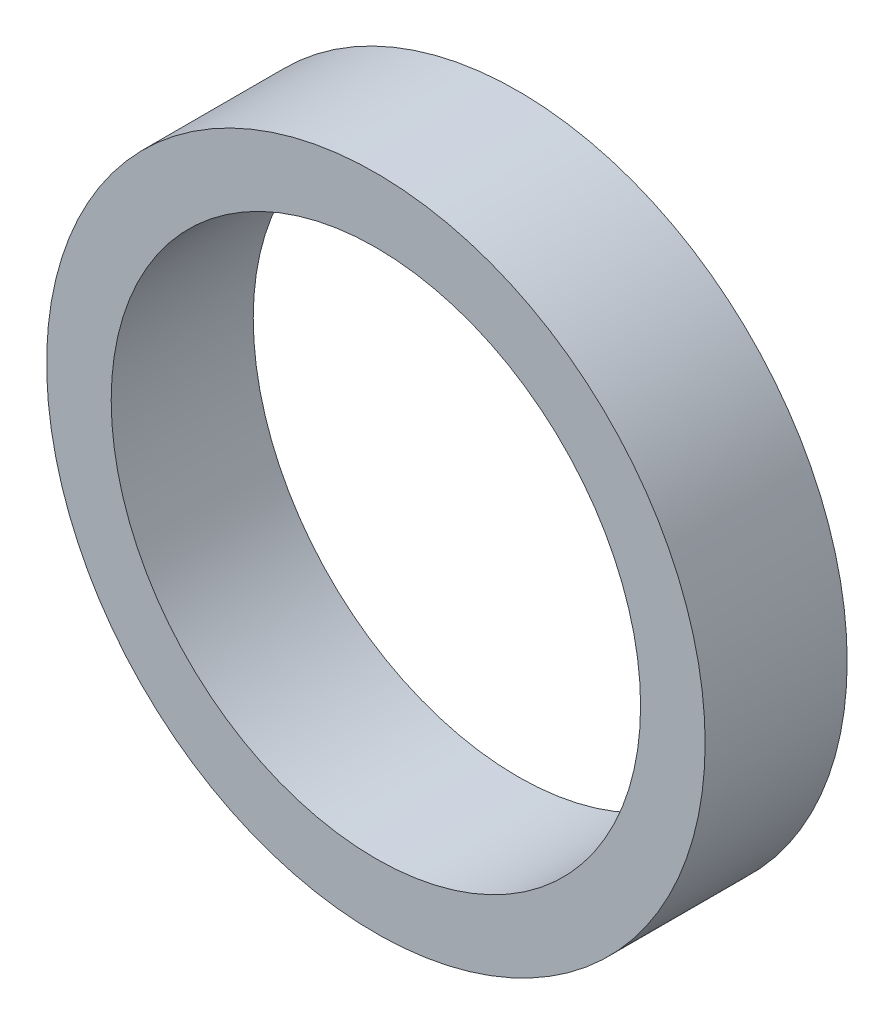
ISO-10303-21;
HEADER;
FILE_DESCRIPTION(('STEP AP214'),'2;1');
FILE_NAME('part.step','',(''),(''),'','','');
FILE_SCHEMA(('AUTOMOTIVE_DESIGN { 1 0 10303 214 1 1 1 1 }'));
ENDSEC;
DATA;
#1=APPLICATION_CONTEXT('core data for automotive mechanical design processes');
#2=APPLICATION_PROTOCOL_DEFINITION('international standard','automotive_design',2000,#1);
#3=PRODUCT_CONTEXT('',#1,'mechanical');
#4=PRODUCT('Part','Part','',(#3));
#5=PRODUCT_RELATED_PRODUCT_CATEGORY('part','',(#4));
#6=PRODUCT_DEFINITION_FORMATION('','',#4);
#7=PRODUCT_DEFINITION_CONTEXT('part definition',#1,'design');
#8=PRODUCT_DEFINITION('design','',#6,#7);
#9=PRODUCT_DEFINITION_SHAPE('','',#8);
#10=(LENGTH_UNIT() NAMED_UNIT(*) SI_UNIT(.MILLI.,.METRE.));
#11=(NAMED_UNIT(*) PLANE_ANGLE_UNIT() SI_UNIT($,.RADIAN.));
#12=(NAMED_UNIT(*) SI_UNIT($,.STERADIAN.) SOLID_ANGLE_UNIT());
#13=UNCERTAINTY_MEASURE_WITH_UNIT(LENGTH_MEASURE(1.E-05),#10,'distance_accuracy_value','');
#14=(GEOMETRIC_REPRESENTATION_CONTEXT(3) GLOBAL_UNCERTAINTY_ASSIGNED_CONTEXT((#13)) GLOBAL_UNIT_ASSIGNED_CONTEXT((#10,
#11,#12)) REPRESENTATION_CONTEXT('',''));
#15=CARTESIAN_POINT('',(0.,0.,0.));
#16=DIRECTION('',(0.,0.,1.));
#17=DIRECTION('',(1.,0.,0.));
#18=AXIS2_PLACEMENT_3D('',#15,#16,#17);
#19=CARTESIAN_POINT('',(0.,0.,11.));
#20=DIRECTION('',(0.,0.,1.));
#21=DIRECTION('',(1.,0.,0.));
#22=AXIS2_PLACEMENT_3D('',#19,#20,#21);
#23=PLANE('',#22);
#24=CARTESIAN_POINT('',(0.,0.,11.));
#25=DIRECTION('',(0.,0.,1.));
#26=DIRECTION('',(1.,0.,0.));
#27=AXIS2_PLACEMENT_3D('',#24,#25,#26);
#28=CIRCLE('',#27,25.5);
#29=CARTESIAN_POINT('',(25.5,0.,11.));
#30=VERTEX_POINT('',#29);
#31=EDGE_CURVE('E10',#30,#30,#28,.T.);
#32=ORIENTED_EDGE('',*,*,#31,.T.);
#33=EDGE_LOOP('',(#32));
#34=FACE_BOUND('',#33,.T.);
#35=CARTESIAN_POINT('',(0.,0.,11.));
#36=DIRECTION('',(0.,0.,1.));
#37=DIRECTION('',(1.,0.,0.));
#38=AXIS2_PLACEMENT_3D('',#35,#36,#37);
#39=CIRCLE('',#38,20.5);
#40=CARTESIAN_POINT('',(20.5,0.,11.));
#41=VERTEX_POINT('',#40);
#42=EDGE_CURVE('E50',#41,#41,#39,.T.);
#43=ORIENTED_EDGE('',*,*,#42,.F.);
#44=EDGE_LOOP('',(#43));
#45=FACE_BOUND('',#44,.T.);
#46=ADVANCED_FACE('F37',(#34,#45),#23,.T.);
#47=CARTESIAN_POINT('',(0.,0.,0.));
#48=DIRECTION('',(0.,0.,1.));
#49=DIRECTION('',(1.,0.,0.));
#50=AXIS2_PLACEMENT_3D('',#47,#48,#49);
#51=PLANE('',#50);
#52=CARTESIAN_POINT('',(0.,0.,0.));
#53=DIRECTION('',(0.,0.,1.));
#54=DIRECTION('',(1.,0.,0.));
#55=AXIS2_PLACEMENT_3D('',#52,#53,#54);
#56=CIRCLE('',#55,25.5);
#57=CARTESIAN_POINT('',(25.5,0.,0.));
#58=VERTEX_POINT('',#57);
#59=EDGE_CURVE('E41',#58,#58,#56,.T.);
#60=ORIENTED_EDGE('',*,*,#59,.F.);
#61=EDGE_LOOP('',(#60));
#62=FACE_BOUND('',#61,.T.);
#63=CARTESIAN_POINT('',(0.,0.,0.));
#64=DIRECTION('',(0.,0.,1.));
#65=DIRECTION('',(1.,0.,0.));
#66=AXIS2_PLACEMENT_3D('',#63,#64,#65);
#67=CIRCLE('',#66,20.5);
#68=CARTESIAN_POINT('',(20.5,0.,0.));
#69=VERTEX_POINT('',#68);
#70=EDGE_CURVE('E52',#69,#69,#67,.T.);
#71=ORIENTED_EDGE('',*,*,#70,.T.);
#72=EDGE_LOOP('',(#71));
#73=FACE_BOUND('',#72,.T.);
#74=ADVANCED_FACE('F64',(#62,#73),#51,.F.);
#75=CARTESIAN_POINT('',(0.,0.,11.));
#76=DIRECTION('',(0.,0.,-1.));
#77=DIRECTION('',(-1.,0.,0.));
#78=AXIS2_PLACEMENT_3D('',#75,#76,#77);
#79=CYLINDRICAL_SURFACE('',#78,25.5);
#80=ORIENTED_EDGE('',*,*,#31,.F.);
#81=EDGE_LOOP('',(#80));
#82=FACE_BOUND('',#81,.T.);
#83=ORIENTED_EDGE('',*,*,#59,.T.);
#84=EDGE_LOOP('',(#83));
#85=FACE_BOUND('',#84,.T.);
#86=ADVANCED_FACE('F39',(#82,#85),#79,.T.);
#87=CARTESIAN_POINT('',(0.,0.,11.));
#88=DIRECTION('',(0.,0.,-1.));
#89=DIRECTION('',(-1.,0.,0.));
#90=AXIS2_PLACEMENT_3D('',#87,#88,#89);
#91=CYLINDRICAL_SURFACE('',#90,20.5);
#92=ORIENTED_EDGE('',*,*,#42,.T.);
#93=EDGE_LOOP('',(#92));
#94=FACE_BOUND('',#93,.T.);
#95=ORIENTED_EDGE('',*,*,#70,.F.);
#96=EDGE_LOOP('',(#95));
#97=FACE_BOUND('',#96,.T.);
#98=ADVANCED_FACE('F60',(#94,#97),#91,.F.);
#99=CLOSED_SHELL('',(#46,#74,#86,#98));
#100=MANIFOLD_SOLID_BREP('B2',#99);
#101=ADVANCED_BREP_SHAPE_REPRESENTATION('',(#18,#100),#14);
#102=SHAPE_DEFINITION_REPRESENTATION(#9,#101);
ENDSEC;
END-ISO-10303-21;
